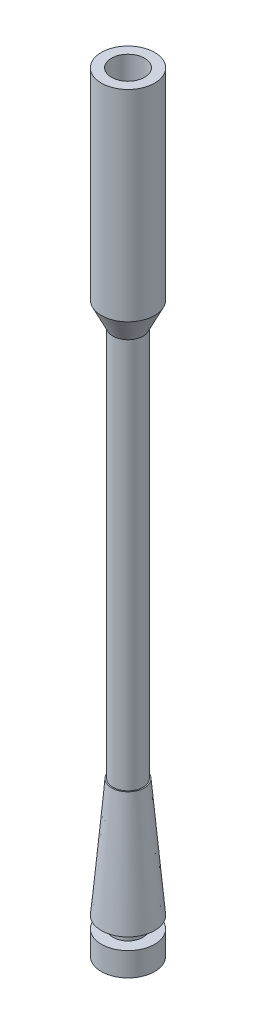
ISO-10303-21;
HEADER;
FILE_DESCRIPTION(('STEP AP214'),'2;1');
FILE_NAME('part.step','',(''),(''),'','','');
FILE_SCHEMA(('AUTOMOTIVE_DESIGN { 1 0 10303 214 1 1 1 1 }'));
ENDSEC;
DATA;
#1=APPLICATION_CONTEXT('core data for automotive mechanical design processes');
#2=APPLICATION_PROTOCOL_DEFINITION('international standard','automotive_design',2000,#1);
#3=PRODUCT_CONTEXT('',#1,'mechanical');
#4=PRODUCT('Part','Part','',(#3));
#5=PRODUCT_RELATED_PRODUCT_CATEGORY('part','',(#4));
#6=PRODUCT_DEFINITION_FORMATION('','',#4);
#7=PRODUCT_DEFINITION_CONTEXT('part definition',#1,'design');
#8=PRODUCT_DEFINITION('design','',#6,#7);
#9=PRODUCT_DEFINITION_SHAPE('','',#8);
#10=(LENGTH_UNIT() NAMED_UNIT(*) SI_UNIT(.MILLI.,.METRE.));
#11=(NAMED_UNIT(*) PLANE_ANGLE_UNIT() SI_UNIT($,.RADIAN.));
#12=(NAMED_UNIT(*) SI_UNIT($,.STERADIAN.) SOLID_ANGLE_UNIT());
#13=UNCERTAINTY_MEASURE_WITH_UNIT(LENGTH_MEASURE(1.E-05),#10,'distance_accuracy_value','');
#14=(GEOMETRIC_REPRESENTATION_CONTEXT(3) GLOBAL_UNCERTAINTY_ASSIGNED_CONTEXT((#13)) GLOBAL_UNIT_ASSIGNED_CONTEXT((#10,
#11,#12)) REPRESENTATION_CONTEXT('',''));
#15=CARTESIAN_POINT('',(0.,0.,0.));
#16=DIRECTION('',(0.,0.,1.));
#17=DIRECTION('',(1.,0.,0.));
#18=AXIS2_PLACEMENT_3D('',#15,#16,#17);
#19=CARTESIAN_POINT('',(-0.522013311509166,0.,-0.51113803418606));
#20=DIRECTION('',(0.,-1.,0.));
#21=DIRECTION('',(0.,0.,1.));
#22=AXIS2_PLACEMENT_3D('',#19,#20,#21);
#23=CONICAL_SURFACE('',#22,2.25,0.0872664625997169);
#24=CARTESIAN_POINT('',(-0.522013311509166,10.,-0.51113803418606));
#25=DIRECTION('',(0.,1.,0.));
#26=DIRECTION('',(0.,0.,1.));
#27=AXIS2_PLACEMENT_3D('',#24,#25,#26);
#28=CIRCLE('',#27,1.37511336474076);
#29=CARTESIAN_POINT('',(-0.522013311509166,10.,0.863975330554696));
#30=VERTEX_POINT('',#29);
#31=EDGE_CURVE('E61',#30,#30,#28,.T.);
#32=ORIENTED_EDGE('',*,*,#31,.F.);
#33=EDGE_LOOP('',(#32));
#34=FACE_BOUND('',#33,.T.);
#35=CARTESIAN_POINT('',(-0.522013311509166,0.,-0.51113803418606));
#36=DIRECTION('',(0.,1.,0.));
#37=DIRECTION('',(0.,0.,1.));
#38=AXIS2_PLACEMENT_3D('',#35,#36,#37);
#39=CIRCLE('',#38,2.25);
#40=CARTESIAN_POINT('',(-0.522013311509166,0.,1.73886196581394));
#41=VERTEX_POINT('',#40);
#42=EDGE_CURVE('E78',#41,#41,#39,.T.);
#43=ORIENTED_EDGE('',*,*,#42,.T.);
#44=EDGE_LOOP('',(#43));
#45=FACE_BOUND('',#44,.T.);
#46=ADVANCED_FACE('F45',(#34,#45),#23,.T.);
#47=CARTESIAN_POINT('',(-0.522013311509166,10.,-0.51113803418606));
#48=DIRECTION('',(0.,1.,0.));
#49=DIRECTION('',(0.,0.,1.));
#50=AXIS2_PLACEMENT_3D('',#47,#48,#49);
#51=PLANE('',#50);
#52=CARTESIAN_POINT('',(-0.522013311509166,10.,-0.51113803418606));
#53=DIRECTION('',(0.,1.,0.));
#54=DIRECTION('',(0.,0.,1.));
#55=AXIS2_PLACEMENT_3D('',#52,#53,#54);
#56=CIRCLE('',#55,1.27451767105577);
#57=CARTESIAN_POINT('',(-0.522013311509166,10.,0.763379636869711));
#58=VERTEX_POINT('',#57);
#59=EDGE_CURVE('E10',#58,#58,#56,.T.);
#60=ORIENTED_EDGE('',*,*,#59,.F.);
#61=EDGE_LOOP('',(#60));
#62=FACE_BOUND('',#61,.T.);
#63=ORIENTED_EDGE('',*,*,#31,.T.);
#64=EDGE_LOOP('',(#63));
#65=FACE_BOUND('',#64,.T.);
#66=ADVANCED_FACE('F147',(#62,#65),#51,.T.);
#67=CARTESIAN_POINT('',(-0.522013311509166,0.,-0.51113803418606));
#68=DIRECTION('',(0.,1.,0.));
#69=DIRECTION('',(0.,0.,1.));
#70=AXIS2_PLACEMENT_3D('',#67,#68,#69);
#71=PLANE('',#70);
#72=CARTESIAN_POINT('',(-0.522013311509166,0.,-0.51113803418606));
#73=DIRECTION('',(0.,-1.,0.));
#74=DIRECTION('',(0.,0.,-1.));
#75=AXIS2_PLACEMENT_3D('',#72,#73,#74);
#76=CIRCLE('',#75,1.25);
#77=CARTESIAN_POINT('',(-0.522013311509166,0.,-1.76113803418606));
#78=VERTEX_POINT('',#77);
#79=EDGE_CURVE('E55',#78,#78,#76,.T.);
#80=ORIENTED_EDGE('',*,*,#79,.F.);
#81=EDGE_LOOP('',(#80));
#82=FACE_BOUND('',#81,.T.);
#83=ORIENTED_EDGE('',*,*,#42,.F.);
#84=EDGE_LOOP('',(#83));
#85=FACE_BOUND('',#84,.T.);
#86=ADVANCED_FACE('F145',(#82,#85),#71,.F.);
#87=CARTESIAN_POINT('',(-0.522013311509166,-1.,-0.51113803418606));
#88=DIRECTION('',(0.,1.,0.));
#89=DIRECTION('',(0.,0.,1.));
#90=AXIS2_PLACEMENT_3D('',#87,#88,#89);
#91=CYLINDRICAL_SURFACE('',#90,1.25);
#92=CARTESIAN_POINT('',(-0.522013311509166,-1.,-0.51113803418606));
#93=DIRECTION('',(0.,-1.,0.));
#94=DIRECTION('',(0.,0.,-1.));
#95=AXIS2_PLACEMENT_3D('',#92,#93,#94);
#96=CIRCLE('',#95,1.25);
#97=CARTESIAN_POINT('',(-0.522013311509166,-1.,-1.76113803418606));
#98=VERTEX_POINT('',#97);
#99=EDGE_CURVE('E71',#98,#98,#96,.T.);
#100=ORIENTED_EDGE('',*,*,#99,.F.);
#101=EDGE_LOOP('',(#100));
#102=FACE_BOUND('',#101,.T.);
#103=ORIENTED_EDGE('',*,*,#79,.T.);
#104=EDGE_LOOP('',(#103));
#105=FACE_BOUND('',#104,.T.);
#106=ADVANCED_FACE('F141',(#102,#105),#91,.T.);
#107=CARTESIAN_POINT('',(-0.522013311509166,-3.,-0.51113803418606));
#108=DIRECTION('',(0.,1.,0.));
#109=DIRECTION('',(0.,0.,1.));
#110=AXIS2_PLACEMENT_3D('',#107,#108,#109);
#111=CYLINDRICAL_SURFACE('',#110,2.25);
#112=CARTESIAN_POINT('',(-0.522013311509166,-3.,-0.51113803418606));
#113=DIRECTION('',(0.,-1.,0.));
#114=DIRECTION('',(0.,0.,-1.));
#115=AXIS2_PLACEMENT_3D('',#112,#113,#114);
#116=CIRCLE('',#115,2.25);
#117=CARTESIAN_POINT('',(-0.522013311509166,-3.,-2.76113803418606));
#118=VERTEX_POINT('',#117);
#119=EDGE_CURVE('E67',#118,#118,#116,.T.);
#120=ORIENTED_EDGE('',*,*,#119,.F.);
#121=EDGE_LOOP('',(#120));
#122=FACE_BOUND('',#121,.T.);
#123=CARTESIAN_POINT('',(-0.522013311509166,-1.,-0.51113803418606));
#124=DIRECTION('',(0.,-1.,0.));
#125=DIRECTION('',(0.,0.,-1.));
#126=AXIS2_PLACEMENT_3D('',#123,#124,#125);
#127=CIRCLE('',#126,2.25);
#128=CARTESIAN_POINT('',(-0.522013311509166,-1.,-2.76113803418606));
#129=VERTEX_POINT('',#128);
#130=EDGE_CURVE('E72',#129,#129,#127,.T.);
#131=ORIENTED_EDGE('',*,*,#130,.T.);
#132=EDGE_LOOP('',(#131));
#133=FACE_BOUND('',#132,.T.);
#134=ADVANCED_FACE('F134',(#122,#133),#111,.T.);
#135=CARTESIAN_POINT('',(-0.522013311509166,-3.,-0.51113803418606));
#136=DIRECTION('',(0.,-1.,0.));
#137=DIRECTION('',(0.,0.,-1.));
#138=AXIS2_PLACEMENT_3D('',#135,#136,#137);
#139=PLANE('',#138);
#140=ORIENTED_EDGE('',*,*,#119,.T.);
#141=EDGE_LOOP('',(#140));
#142=FACE_BOUND('',#141,.T.);
#143=ADVANCED_FACE('F131',(#142),#139,.T.);
#144=CARTESIAN_POINT('',(-0.522013311509166,-1.,-0.51113803418606));
#145=DIRECTION('',(0.,-1.,0.));
#146=DIRECTION('',(0.,0.,-1.));
#147=AXIS2_PLACEMENT_3D('',#144,#145,#146);
#148=PLANE('',#147);
#149=ORIENTED_EDGE('',*,*,#99,.T.);
#150=EDGE_LOOP('',(#149));
#151=FACE_BOUND('',#150,.T.);
#152=ORIENTED_EDGE('',*,*,#130,.F.);
#153=EDGE_LOOP('',(#152));
#154=FACE_BOUND('',#153,.T.);
#155=ADVANCED_FACE('F129',(#151,#154),#148,.F.);
#156=CARTESIAN_POINT('',(-0.522013311509166,43.,-0.51113803418606));
#157=DIRECTION('',(0.,-1.,0.));
#158=DIRECTION('',(0.,0.,-1.));
#159=AXIS2_PLACEMENT_3D('',#156,#157,#158);
#160=CYLINDRICAL_SURFACE('',#159,1.27451767105577);
#161=CARTESIAN_POINT('',(-0.522013311509166,43.,-0.51113803418606));
#162=DIRECTION('',(0.,1.,0.));
#163=DIRECTION('',(0.,0.,1.));
#164=AXIS2_PLACEMENT_3D('',#161,#162,#163);
#165=CIRCLE('',#164,1.27451767105577);
#166=CARTESIAN_POINT('',(-0.522013311509166,43.,0.763379636869711));
#167=VERTEX_POINT('',#166);
#168=EDGE_CURVE('E65',#167,#167,#165,.T.);
#169=ORIENTED_EDGE('',*,*,#168,.F.);
#170=EDGE_LOOP('',(#169));
#171=FACE_BOUND('',#170,.T.);
#172=ORIENTED_EDGE('',*,*,#59,.T.);
#173=EDGE_LOOP('',(#172));
#174=FACE_BOUND('',#173,.T.);
#175=ADVANCED_FACE('F126',(#171,#174),#160,.T.);
#176=CARTESIAN_POINT('',(-0.522013311509166,43.,-0.51113803418606));
#177=DIRECTION('',(0.,1.,0.));
#178=DIRECTION('',(0.,0.,1.));
#179=AXIS2_PLACEMENT_3D('',#176,#177,#178);
#180=CONICAL_SURFACE('',#179,1.27451767105577,0.453785605518526);
#181=CARTESIAN_POINT('',(-0.522013311509166,45.,-0.51113803418606));
#182=DIRECTION('',(0.,1.,0.));
#183=DIRECTION('',(0.,0.,1.));
#184=AXIS2_PLACEMENT_3D('',#181,#182,#183);
#185=CIRCLE('',#184,2.25);
#186=CARTESIAN_POINT('',(-0.522013311509165,45.,1.73886196581394));
#187=VERTEX_POINT('',#186);
#188=EDGE_CURVE('E88',#187,#187,#185,.T.);
#189=ORIENTED_EDGE('',*,*,#188,.F.);
#190=EDGE_LOOP('',(#189));
#191=FACE_BOUND('',#190,.T.);
#192=ORIENTED_EDGE('',*,*,#168,.T.);
#193=EDGE_LOOP('',(#192));
#194=FACE_BOUND('',#193,.T.);
#195=ADVANCED_FACE('F89',(#191,#194),#180,.T.);
#196=CARTESIAN_POINT('',(-0.522013311509166,62.,-0.51113803418606));
#197=DIRECTION('',(0.,-1.,0.));
#198=DIRECTION('',(0.,0.,-1.));
#199=AXIS2_PLACEMENT_3D('',#196,#197,#198);
#200=CYLINDRICAL_SURFACE('',#199,2.25);
#201=CARTESIAN_POINT('',(-0.522013311509166,62.,-0.51113803418606));
#202=DIRECTION('',(0.,1.,0.));
#203=DIRECTION('',(0.,0.,1.));
#204=AXIS2_PLACEMENT_3D('',#201,#202,#203);
#205=CIRCLE('',#204,2.25);
#206=CARTESIAN_POINT('',(-0.522013311509166,62.,1.73886196581394));
#207=VERTEX_POINT('',#206);
#208=EDGE_CURVE('E94',#207,#207,#205,.T.);
#209=ORIENTED_EDGE('',*,*,#208,.F.);
#210=EDGE_LOOP('',(#209));
#211=FACE_BOUND('',#210,.T.);
#212=ORIENTED_EDGE('',*,*,#188,.T.);
#213=EDGE_LOOP('',(#212));
#214=FACE_BOUND('',#213,.T.);
#215=ADVANCED_FACE('F111',(#211,#214),#200,.T.);
#216=CARTESIAN_POINT('',(-0.522013311509166,62.,-0.51113803418606));
#217=DIRECTION('',(0.,1.,0.));
#218=DIRECTION('',(0.,0.,1.));
#219=AXIS2_PLACEMENT_3D('',#216,#217,#218);
#220=PLANE('',#219);
#221=CARTESIAN_POINT('',(-0.522013311509166,62.,-0.51113803418606));
#222=DIRECTION('',(0.,1.,0.));
#223=DIRECTION('',(0.,0.,1.));
#224=AXIS2_PLACEMENT_3D('',#221,#222,#223);
#225=CIRCLE('',#224,1.4);
#226=CARTESIAN_POINT('',(-0.522013311509166,62.,0.88886196581394));
#227=VERTEX_POINT('',#226);
#228=EDGE_CURVE('E105',#227,#227,#225,.T.);
#229=ORIENTED_EDGE('',*,*,#228,.F.);
#230=EDGE_LOOP('',(#229));
#231=FACE_BOUND('',#230,.T.);
#232=ORIENTED_EDGE('',*,*,#208,.T.);
#233=EDGE_LOOP('',(#232));
#234=FACE_BOUND('',#233,.T.);
#235=ADVANCED_FACE('F120',(#231,#234),#220,.T.);
#236=CARTESIAN_POINT('',(-0.522013311509166,47.,-0.51113803418606));
#237=DIRECTION('',(0.,1.,0.));
#238=DIRECTION('',(0.,0.,1.));
#239=AXIS2_PLACEMENT_3D('',#236,#237,#238);
#240=CYLINDRICAL_SURFACE('',#239,1.4);
#241=CARTESIAN_POINT('',(-0.522013311509166,47.,-0.51113803418606));
#242=DIRECTION('',(0.,1.,0.));
#243=DIRECTION('',(0.,0.,1.));
#244=AXIS2_PLACEMENT_3D('',#241,#242,#243);
#245=CIRCLE('',#244,1.4);
#246=CARTESIAN_POINT('',(-0.522013311509166,47.,0.88886196581394));
#247=VERTEX_POINT('',#246);
#248=EDGE_CURVE('E99',#247,#247,#245,.T.);
#249=ORIENTED_EDGE('',*,*,#248,.F.);
#250=EDGE_LOOP('',(#249));
#251=FACE_BOUND('',#250,.T.);
#252=ORIENTED_EDGE('',*,*,#228,.T.);
#253=EDGE_LOOP('',(#252));
#254=FACE_BOUND('',#253,.T.);
#255=ADVANCED_FACE('F204',(#251,#254),#240,.F.);
#256=CARTESIAN_POINT('',(-0.522013311509166,47.,-0.51113803418606));
#257=DIRECTION('',(0.,1.,0.));
#258=DIRECTION('',(0.,0.,1.));
#259=AXIS2_PLACEMENT_3D('',#256,#257,#258);
#260=PLANE('',#259);
#261=ORIENTED_EDGE('',*,*,#248,.T.);
#262=EDGE_LOOP('',(#261));
#263=FACE_BOUND('',#262,.T.);
#264=ADVANCED_FACE('F214',(#263),#260,.T.);
#265=CLOSED_SHELL('',(#46,#66,#86,#106,#134,#143,#155,#175,#195,#215,#235,#255,#264));
#266=MANIFOLD_SOLID_BREP('B2',#265);
#267=ADVANCED_BREP_SHAPE_REPRESENTATION('',(#18,#266),#14);
#268=SHAPE_DEFINITION_REPRESENTATION(#9,#267);
ENDSEC;
END-ISO-10303-21;
